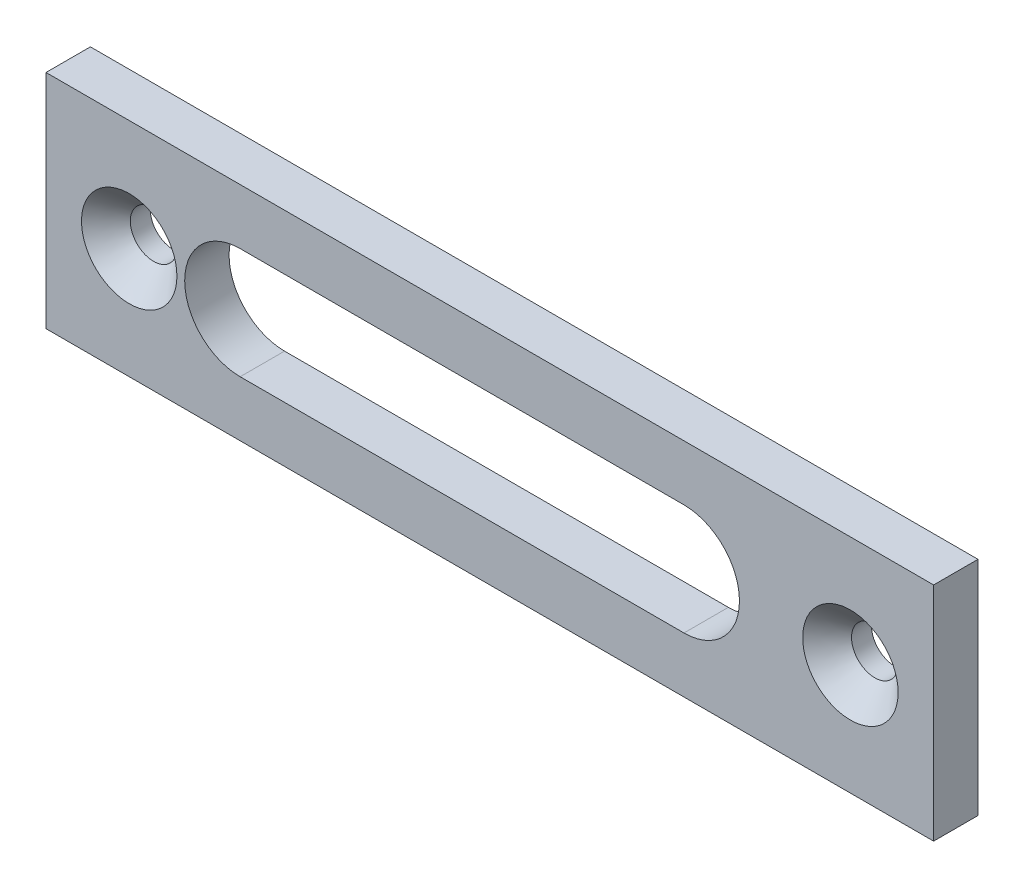
ISO-10303-21;
HEADER;
FILE_DESCRIPTION(('STEP AP214'),'2;1');
FILE_NAME('part.step','',(''),(''),'','','');
FILE_SCHEMA(('AUTOMOTIVE_DESIGN { 1 0 10303 214 1 1 1 1 }'));
ENDSEC;
DATA;
#1=APPLICATION_CONTEXT('core data for automotive mechanical design processes');
#2=APPLICATION_PROTOCOL_DEFINITION('international standard','automotive_design',2000,#1);
#3=PRODUCT_CONTEXT('',#1,'mechanical');
#4=PRODUCT('Part','Part','',(#3));
#5=PRODUCT_RELATED_PRODUCT_CATEGORY('part','',(#4));
#6=PRODUCT_DEFINITION_FORMATION('','',#4);
#7=PRODUCT_DEFINITION_CONTEXT('part definition',#1,'design');
#8=PRODUCT_DEFINITION('design','',#6,#7);
#9=PRODUCT_DEFINITION_SHAPE('','',#8);
#10=(LENGTH_UNIT() NAMED_UNIT(*) SI_UNIT(.MILLI.,.METRE.));
#11=(NAMED_UNIT(*) PLANE_ANGLE_UNIT() SI_UNIT($,.RADIAN.));
#12=(NAMED_UNIT(*) SI_UNIT($,.STERADIAN.) SOLID_ANGLE_UNIT());
#13=UNCERTAINTY_MEASURE_WITH_UNIT(LENGTH_MEASURE(1.E-05),#10,'distance_accuracy_value','');
#14=(GEOMETRIC_REPRESENTATION_CONTEXT(3) GLOBAL_UNCERTAINTY_ASSIGNED_CONTEXT((#13)) GLOBAL_UNIT_ASSIGNED_CONTEXT((#10,
#11,#12)) REPRESENTATION_CONTEXT('',''));
#15=CARTESIAN_POINT('',(0.,0.,0.));
#16=DIRECTION('',(0.,0.,1.));
#17=DIRECTION('',(1.,0.,0.));
#18=AXIS2_PLACEMENT_3D('',#15,#16,#17);
#19=CARTESIAN_POINT('',(-40.,10.,4.));
#20=DIRECTION('',(0.,0.,1.));
#21=DIRECTION('',(1.,0.,0.));
#22=AXIS2_PLACEMENT_3D('',#19,#20,#21);
#23=PLANE('',#22);
#24=CARTESIAN_POINT('',(32.5,0.,4.));
#25=DIRECTION('',(0.,0.,1.));
#26=DIRECTION('',(1.,0.,0.));
#27=AXIS2_PLACEMENT_3D('',#24,#25,#26);
#28=CIRCLE('',#27,4.30000000000001);
#29=CARTESIAN_POINT('',(36.8,0.,4.));
#30=VERTEX_POINT('',#29);
#31=EDGE_CURVE('E34',#30,#30,#28,.F.);
#32=ORIENTED_EDGE('',*,*,#31,.T.);
#33=EDGE_LOOP('',(#32));
#34=FACE_BOUND('',#33,.T.);
#35=CARTESIAN_POINT('',(-32.5,0.,4.));
#36=DIRECTION('',(0.,0.,1.));
#37=DIRECTION('',(1.,0.,0.));
#38=AXIS2_PLACEMENT_3D('',#35,#36,#37);
#39=CIRCLE('',#38,4.30000000000001);
#40=CARTESIAN_POINT('',(-28.2,0.,4.));
#41=VERTEX_POINT('',#40);
#42=EDGE_CURVE('E165',#41,#41,#39,.F.);
#43=ORIENTED_EDGE('',*,*,#42,.T.);
#44=EDGE_LOOP('',(#43));
#45=FACE_BOUND('',#44,.T.);
#46=DIRECTION('',(0.,-1.,0.));
#47=VECTOR('',#46,1.);
#48=CARTESIAN_POINT('',(-40.,10.,4.));
#49=LINE('',#48,#47);
#50=CARTESIAN_POINT('',(-40.,10.,4.));
#51=VERTEX_POINT('',#50);
#52=CARTESIAN_POINT('',(-40.,-10.,4.));
#53=VERTEX_POINT('',#52);
#54=EDGE_CURVE('E141',#51,#53,#49,.T.);
#55=ORIENTED_EDGE('',*,*,#54,.T.);
#56=DIRECTION('',(1.,0.,0.));
#57=VECTOR('',#56,1.);
#58=CARTESIAN_POINT('',(-40.,-10.,4.));
#59=LINE('',#58,#57);
#60=CARTESIAN_POINT('',(40.,-9.99999999999999,4.));
#61=VERTEX_POINT('',#60);
#62=EDGE_CURVE('E144',#53,#61,#59,.T.);
#63=ORIENTED_EDGE('',*,*,#62,.T.);
#64=DIRECTION('',(0.,1.,0.));
#65=VECTOR('',#64,1.);
#66=CARTESIAN_POINT('',(40.,10.,4.));
#67=LINE('',#66,#65);
#68=CARTESIAN_POINT('',(40.,10.,4.));
#69=VERTEX_POINT('',#68);
#70=EDGE_CURVE('E146',#61,#69,#67,.T.);
#71=ORIENTED_EDGE('',*,*,#70,.T.);
#72=DIRECTION('',(-1.,0.,0.));
#73=VECTOR('',#72,1.);
#74=CARTESIAN_POINT('',(-40.,10.,4.));
#75=LINE('',#74,#73);
#76=EDGE_CURVE('E148',#69,#51,#75,.T.);
#77=ORIENTED_EDGE('',*,*,#76,.T.);
#78=EDGE_LOOP('',(#55,#63,#71,#77));
#79=FACE_BOUND('',#78,.T.);
#80=DIRECTION('',(1.,0.,0.));
#81=VECTOR('',#80,1.);
#82=CARTESIAN_POINT('',(-22.5,-5.,4.));
#83=LINE('',#82,#81);
#84=CARTESIAN_POINT('',(-22.5,-5.,4.));
#85=VERTEX_POINT('',#84);
#86=CARTESIAN_POINT('',(17.5,-5.,4.));
#87=VERTEX_POINT('',#86);
#88=EDGE_CURVE('E117',#85,#87,#83,.T.);
#89=ORIENTED_EDGE('',*,*,#88,.F.);
#90=CARTESIAN_POINT('',(-22.5,0.,4.));
#91=DIRECTION('',(0.,0.,1.));
#92=DIRECTION('',(1.,0.,0.));
#93=AXIS2_PLACEMENT_3D('',#90,#91,#92);
#94=CIRCLE('',#93,5.);
#95=CARTESIAN_POINT('',(-22.5,5.,4.));
#96=VERTEX_POINT('',#95);
#97=EDGE_CURVE('E106',#96,#85,#94,.T.);
#98=ORIENTED_EDGE('',*,*,#97,.F.);
#99=DIRECTION('',(-1.,0.,0.));
#100=VECTOR('',#99,1.);
#101=CARTESIAN_POINT('',(-22.5,5.,4.));
#102=LINE('',#101,#100);
#103=CARTESIAN_POINT('',(17.5,5.,4.));
#104=VERTEX_POINT('',#103);
#105=EDGE_CURVE('E121',#104,#96,#102,.T.);
#106=ORIENTED_EDGE('',*,*,#105,.F.);
#107=CARTESIAN_POINT('',(17.5,0.,4.));
#108=DIRECTION('',(0.,0.,1.));
#109=DIRECTION('',(1.,0.,0.));
#110=AXIS2_PLACEMENT_3D('',#107,#108,#109);
#111=CIRCLE('',#110,5.);
#112=EDGE_CURVE('E119',#87,#104,#111,.T.);
#113=ORIENTED_EDGE('',*,*,#112,.F.);
#114=EDGE_LOOP('',(#89,#98,#106,#113));
#115=FACE_BOUND('',#114,.T.);
#116=ADVANCED_FACE('F26',(#34,#45,#79,#115),#23,.T.);
#117=CARTESIAN_POINT('',(-40.,10.,0.));
#118=DIRECTION('',(0.,0.,1.));
#119=DIRECTION('',(1.,0.,0.));
#120=AXIS2_PLACEMENT_3D('',#117,#118,#119);
#121=PLANE('',#120);
#122=CARTESIAN_POINT('',(32.5,0.,0.));
#123=DIRECTION('',(0.,0.,1.));
#124=DIRECTION('',(1.,0.,0.));
#125=AXIS2_PLACEMENT_3D('',#122,#123,#124);
#126=CIRCLE('',#125,2.1);
#127=CARTESIAN_POINT('',(34.6,0.,0.));
#128=VERTEX_POINT('',#127);
#129=EDGE_CURVE('E107',#128,#128,#126,.T.);
#130=ORIENTED_EDGE('',*,*,#129,.T.);
#131=EDGE_LOOP('',(#130));
#132=FACE_BOUND('',#131,.T.);
#133=DIRECTION('',(0.,-1.,0.));
#134=VECTOR('',#133,1.);
#135=CARTESIAN_POINT('',(-40.,10.,0.));
#136=LINE('',#135,#134);
#137=CARTESIAN_POINT('',(-40.,10.,0.));
#138=VERTEX_POINT('',#137);
#139=CARTESIAN_POINT('',(-40.,-10.,0.));
#140=VERTEX_POINT('',#139);
#141=EDGE_CURVE('E132',#138,#140,#136,.T.);
#142=ORIENTED_EDGE('',*,*,#141,.F.);
#143=DIRECTION('',(-1.,0.,0.));
#144=VECTOR('',#143,1.);
#145=CARTESIAN_POINT('',(-40.,10.,0.));
#146=LINE('',#145,#144);
#147=CARTESIAN_POINT('',(40.,10.,0.));
#148=VERTEX_POINT('',#147);
#149=EDGE_CURVE('E139',#148,#138,#146,.T.);
#150=ORIENTED_EDGE('',*,*,#149,.F.);
#151=DIRECTION('',(0.,1.,0.));
#152=VECTOR('',#151,1.);
#153=CARTESIAN_POINT('',(40.,10.,0.));
#154=LINE('',#153,#152);
#155=CARTESIAN_POINT('',(40.,-9.99999999999999,0.));
#156=VERTEX_POINT('',#155);
#157=EDGE_CURVE('E137',#156,#148,#154,.T.);
#158=ORIENTED_EDGE('',*,*,#157,.F.);
#159=DIRECTION('',(1.,0.,0.));
#160=VECTOR('',#159,1.);
#161=CARTESIAN_POINT('',(-40.,-10.,0.));
#162=LINE('',#161,#160);
#163=EDGE_CURVE('E135',#140,#156,#162,.T.);
#164=ORIENTED_EDGE('',*,*,#163,.F.);
#165=EDGE_LOOP('',(#142,#150,#158,#164));
#166=FACE_BOUND('',#165,.T.);
#167=CARTESIAN_POINT('',(-32.5,0.,0.));
#168=DIRECTION('',(0.,0.,1.));
#169=DIRECTION('',(1.,0.,0.));
#170=AXIS2_PLACEMENT_3D('',#167,#168,#169);
#171=CIRCLE('',#170,2.1);
#172=CARTESIAN_POINT('',(-30.4,0.,0.));
#173=VERTEX_POINT('',#172);
#174=EDGE_CURVE('E129',#173,#173,#171,.T.);
#175=ORIENTED_EDGE('',*,*,#174,.T.);
#176=EDGE_LOOP('',(#175));
#177=FACE_BOUND('',#176,.T.);
#178=CARTESIAN_POINT('',(-22.5,0.,0.));
#179=DIRECTION('',(0.,0.,1.));
#180=DIRECTION('',(1.,0.,0.));
#181=AXIS2_PLACEMENT_3D('',#178,#179,#180);
#182=CIRCLE('',#181,5.);
#183=CARTESIAN_POINT('',(-22.5,5.,0.));
#184=VERTEX_POINT('',#183);
#185=CARTESIAN_POINT('',(-22.5,-5.,0.));
#186=VERTEX_POINT('',#185);
#187=EDGE_CURVE('E49',#184,#186,#182,.T.);
#188=ORIENTED_EDGE('',*,*,#187,.T.);
#189=DIRECTION('',(1.,0.,0.));
#190=VECTOR('',#189,1.);
#191=CARTESIAN_POINT('',(-22.5,-5.,0.));
#192=LINE('',#191,#190);
#193=CARTESIAN_POINT('',(17.5,-5.,0.));
#194=VERTEX_POINT('',#193);
#195=EDGE_CURVE('E93',#186,#194,#192,.T.);
#196=ORIENTED_EDGE('',*,*,#195,.T.);
#197=CARTESIAN_POINT('',(17.5,0.,0.));
#198=DIRECTION('',(0.,0.,1.));
#199=DIRECTION('',(1.,0.,0.));
#200=AXIS2_PLACEMENT_3D('',#197,#198,#199);
#201=CIRCLE('',#200,5.);
#202=CARTESIAN_POINT('',(17.5,5.,0.));
#203=VERTEX_POINT('',#202);
#204=EDGE_CURVE('E102',#194,#203,#201,.T.);
#205=ORIENTED_EDGE('',*,*,#204,.T.);
#206=DIRECTION('',(-1.,0.,0.));
#207=VECTOR('',#206,1.);
#208=CARTESIAN_POINT('',(-22.5,5.,0.));
#209=LINE('',#208,#207);
#210=EDGE_CURVE('E111',#203,#184,#209,.T.);
#211=ORIENTED_EDGE('',*,*,#210,.T.);
#212=EDGE_LOOP('',(#188,#196,#205,#211));
#213=FACE_BOUND('',#212,.T.);
#214=ADVANCED_FACE('F110',(#132,#166,#177,#213),#121,.F.);
#215=CARTESIAN_POINT('',(-40.,10.,4.));
#216=DIRECTION('',(1.,0.,0.));
#217=DIRECTION('',(0.,0.,-1.));
#218=AXIS2_PLACEMENT_3D('',#215,#216,#217);
#219=PLANE('',#218);
#220=ORIENTED_EDGE('',*,*,#141,.T.);
#221=DIRECTION('',(0.,0.,-1.));
#222=VECTOR('',#221,1.);
#223=CARTESIAN_POINT('',(-40.,-10.,4.));
#224=LINE('',#223,#222);
#225=EDGE_CURVE('E159',#53,#140,#224,.T.);
#226=ORIENTED_EDGE('',*,*,#225,.F.);
#227=ORIENTED_EDGE('',*,*,#54,.F.);
#228=DIRECTION('',(0.,0.,-1.));
#229=VECTOR('',#228,1.);
#230=CARTESIAN_POINT('',(-40.,10.,4.));
#231=LINE('',#230,#229);
#232=EDGE_CURVE('E150',#51,#138,#231,.T.);
#233=ORIENTED_EDGE('',*,*,#232,.T.);
#234=EDGE_LOOP('',(#220,#226,#227,#233));
#235=FACE_BOUND('',#234,.T.);
#236=ADVANCED_FACE('F28',(#235),#219,.F.);
#237=CARTESIAN_POINT('',(-40.,-10.,4.));
#238=DIRECTION('',(0.,1.,0.));
#239=DIRECTION('',(-1.,0.,0.));
#240=AXIS2_PLACEMENT_3D('',#237,#238,#239);
#241=PLANE('',#240);
#242=ORIENTED_EDGE('',*,*,#163,.T.);
#243=DIRECTION('',(0.,0.,-1.));
#244=VECTOR('',#243,1.);
#245=CARTESIAN_POINT('',(40.,-9.99999999999999,4.));
#246=LINE('',#245,#244);
#247=EDGE_CURVE('E156',#61,#156,#246,.T.);
#248=ORIENTED_EDGE('',*,*,#247,.F.);
#249=ORIENTED_EDGE('',*,*,#62,.F.);
#250=ORIENTED_EDGE('',*,*,#225,.T.);
#251=EDGE_LOOP('',(#242,#248,#249,#250));
#252=FACE_BOUND('',#251,.T.);
#253=ADVANCED_FACE('F212',(#252),#241,.F.);
#254=CARTESIAN_POINT('',(40.,10.,4.));
#255=DIRECTION('',(-1.,0.,0.));
#256=DIRECTION('',(0.,0.,1.));
#257=AXIS2_PLACEMENT_3D('',#254,#255,#256);
#258=PLANE('',#257);
#259=ORIENTED_EDGE('',*,*,#157,.T.);
#260=DIRECTION('',(0.,0.,-1.));
#261=VECTOR('',#260,1.);
#262=CARTESIAN_POINT('',(40.,10.,4.));
#263=LINE('',#262,#261);
#264=EDGE_CURVE('E153',#69,#148,#263,.T.);
#265=ORIENTED_EDGE('',*,*,#264,.F.);
#266=ORIENTED_EDGE('',*,*,#70,.F.);
#267=ORIENTED_EDGE('',*,*,#247,.T.);
#268=EDGE_LOOP('',(#259,#265,#266,#267));
#269=FACE_BOUND('',#268,.T.);
#270=ADVANCED_FACE('F203',(#269),#258,.F.);
#271=CARTESIAN_POINT('',(-40.,10.,4.));
#272=DIRECTION('',(0.,-1.,0.));
#273=DIRECTION('',(1.,0.,0.));
#274=AXIS2_PLACEMENT_3D('',#271,#272,#273);
#275=PLANE('',#274);
#276=ORIENTED_EDGE('',*,*,#149,.T.);
#277=ORIENTED_EDGE('',*,*,#232,.F.);
#278=ORIENTED_EDGE('',*,*,#76,.F.);
#279=ORIENTED_EDGE('',*,*,#264,.T.);
#280=EDGE_LOOP('',(#276,#277,#278,#279));
#281=FACE_BOUND('',#280,.T.);
#282=ADVANCED_FACE('F196',(#281),#275,.F.);
#283=CARTESIAN_POINT('',(-32.5,0.,4.));
#284=DIRECTION('',(0.,0.,-1.));
#285=DIRECTION('',(-1.,0.,0.));
#286=AXIS2_PLACEMENT_3D('',#283,#284,#285);
#287=CYLINDRICAL_SURFACE('',#286,2.1);
#288=CARTESIAN_POINT('',(-32.5,0.,1.8));
#289=DIRECTION('',(0.,0.,1.));
#290=DIRECTION('',(1.,0.,0.));
#291=AXIS2_PLACEMENT_3D('',#288,#289,#290);
#292=CIRCLE('',#291,2.1);
#293=CARTESIAN_POINT('',(-30.4,0.,1.8));
#294=VERTEX_POINT('',#293);
#295=EDGE_CURVE('E11',#294,#294,#292,.T.);
#296=ORIENTED_EDGE('',*,*,#295,.T.);
#297=EDGE_LOOP('',(#296));
#298=FACE_BOUND('',#297,.T.);
#299=ORIENTED_EDGE('',*,*,#174,.F.);
#300=EDGE_LOOP('',(#299));
#301=FACE_BOUND('',#300,.T.);
#302=ADVANCED_FACE('F183',(#298,#301),#287,.F.);
#303=CARTESIAN_POINT('',(32.5,0.,4.));
#304=DIRECTION('',(0.,0.,-1.));
#305=DIRECTION('',(-1.,0.,0.));
#306=AXIS2_PLACEMENT_3D('',#303,#304,#305);
#307=CYLINDRICAL_SURFACE('',#306,2.1);
#308=CARTESIAN_POINT('',(32.5,0.,1.8));
#309=DIRECTION('',(0.,0.,1.));
#310=DIRECTION('',(1.,0.,0.));
#311=AXIS2_PLACEMENT_3D('',#308,#309,#310);
#312=CIRCLE('',#311,2.1);
#313=CARTESIAN_POINT('',(34.6,0.,1.8));
#314=VERTEX_POINT('',#313);
#315=EDGE_CURVE('E162',#314,#314,#312,.T.);
#316=ORIENTED_EDGE('',*,*,#315,.T.);
#317=EDGE_LOOP('',(#316));
#318=FACE_BOUND('',#317,.T.);
#319=ORIENTED_EDGE('',*,*,#129,.F.);
#320=EDGE_LOOP('',(#319));
#321=FACE_BOUND('',#320,.T.);
#322=ADVANCED_FACE('F180',(#318,#321),#307,.F.);
#323=CARTESIAN_POINT('',(-22.5,0.,4.));
#324=DIRECTION('',(0.,0.,-1.));
#325=DIRECTION('',(-1.,0.,0.));
#326=AXIS2_PLACEMENT_3D('',#323,#324,#325);
#327=CYLINDRICAL_SURFACE('',#326,5.);
#328=ORIENTED_EDGE('',*,*,#187,.F.);
#329=DIRECTION('',(0.,0.,-1.));
#330=VECTOR('',#329,1.);
#331=CARTESIAN_POINT('',(-22.5,5.,4.));
#332=LINE('',#331,#330);
#333=EDGE_CURVE('E123',#96,#184,#332,.T.);
#334=ORIENTED_EDGE('',*,*,#333,.F.);
#335=ORIENTED_EDGE('',*,*,#97,.T.);
#336=DIRECTION('',(0.,0.,-1.));
#337=VECTOR('',#336,1.);
#338=CARTESIAN_POINT('',(-22.5,-5.,4.));
#339=LINE('',#338,#337);
#340=EDGE_CURVE('E95',#85,#186,#339,.T.);
#341=ORIENTED_EDGE('',*,*,#340,.T.);
#342=EDGE_LOOP('',(#328,#334,#335,#341));
#343=FACE_BOUND('',#342,.T.);
#344=ADVANCED_FACE('F104',(#343),#327,.F.);
#345=CARTESIAN_POINT('',(-22.5,-5.,4.));
#346=DIRECTION('',(0.,1.,0.));
#347=DIRECTION('',(-1.,0.,0.));
#348=AXIS2_PLACEMENT_3D('',#345,#346,#347);
#349=PLANE('',#348);
#350=ORIENTED_EDGE('',*,*,#195,.F.);
#351=ORIENTED_EDGE('',*,*,#340,.F.);
#352=ORIENTED_EDGE('',*,*,#88,.T.);
#353=DIRECTION('',(0.,0.,-1.));
#354=VECTOR('',#353,1.);
#355=CARTESIAN_POINT('',(17.5,-5.,4.));
#356=LINE('',#355,#354);
#357=EDGE_CURVE('E98',#87,#194,#356,.T.);
#358=ORIENTED_EDGE('',*,*,#357,.T.);
#359=EDGE_LOOP('',(#350,#351,#352,#358));
#360=FACE_BOUND('',#359,.T.);
#361=ADVANCED_FACE('F94',(#360),#349,.T.);
#362=CARTESIAN_POINT('',(17.5,0.,4.));
#363=DIRECTION('',(0.,0.,-1.));
#364=DIRECTION('',(-1.,0.,0.));
#365=AXIS2_PLACEMENT_3D('',#362,#363,#364);
#366=CYLINDRICAL_SURFACE('',#365,5.);
#367=ORIENTED_EDGE('',*,*,#204,.F.);
#368=ORIENTED_EDGE('',*,*,#357,.F.);
#369=ORIENTED_EDGE('',*,*,#112,.T.);
#370=DIRECTION('',(0.,0.,-1.));
#371=VECTOR('',#370,1.);
#372=CARTESIAN_POINT('',(17.5,5.,4.));
#373=LINE('',#372,#371);
#374=EDGE_CURVE('E41',#104,#203,#373,.T.);
#375=ORIENTED_EDGE('',*,*,#374,.T.);
#376=EDGE_LOOP('',(#367,#368,#369,#375));
#377=FACE_BOUND('',#376,.T.);
#378=ADVANCED_FACE('F233',(#377),#366,.F.);
#379=CARTESIAN_POINT('',(-22.5,5.,4.));
#380=DIRECTION('',(0.,-1.,0.));
#381=DIRECTION('',(1.,0.,0.));
#382=AXIS2_PLACEMENT_3D('',#379,#380,#381);
#383=PLANE('',#382);
#384=ORIENTED_EDGE('',*,*,#210,.F.);
#385=ORIENTED_EDGE('',*,*,#374,.F.);
#386=ORIENTED_EDGE('',*,*,#105,.T.);
#387=ORIENTED_EDGE('',*,*,#333,.T.);
#388=EDGE_LOOP('',(#384,#385,#386,#387));
#389=FACE_BOUND('',#388,.T.);
#390=ADVANCED_FACE('F176',(#389),#383,.T.);
#391=CARTESIAN_POINT('',(32.5,0.,1.8));
#392=DIRECTION('',(0.,0.,1.));
#393=DIRECTION('',(1.,0.,0.));
#394=AXIS2_PLACEMENT_3D('',#391,#392,#393);
#395=CONICAL_SURFACE('',#394,2.1,0.78539816339745);
#396=ORIENTED_EDGE('',*,*,#31,.F.);
#397=EDGE_LOOP('',(#396));
#398=FACE_BOUND('',#397,.T.);
#399=ORIENTED_EDGE('',*,*,#315,.F.);
#400=EDGE_LOOP('',(#399));
#401=FACE_BOUND('',#400,.T.);
#402=ADVANCED_FACE('F172',(#398,#401),#395,.F.);
#403=CARTESIAN_POINT('',(-32.5,0.,1.8));
#404=DIRECTION('',(0.,0.,1.));
#405=DIRECTION('',(1.,0.,0.));
#406=AXIS2_PLACEMENT_3D('',#403,#404,#405);
#407=CONICAL_SURFACE('',#406,2.1,0.785398163397451);
#408=ORIENTED_EDGE('',*,*,#42,.F.);
#409=EDGE_LOOP('',(#408));
#410=FACE_BOUND('',#409,.T.);
#411=ORIENTED_EDGE('',*,*,#295,.F.);
#412=EDGE_LOOP('',(#411));
#413=FACE_BOUND('',#412,.T.);
#414=ADVANCED_FACE('F175',(#410,#413),#407,.F.);
#415=CLOSED_SHELL('',(#116,#214,#236,#253,#270,#282,#302,#322,#344,#361,#378,#390,#402,#414));
#416=MANIFOLD_SOLID_BREP('B2',#415);
#417=ADVANCED_BREP_SHAPE_REPRESENTATION('',(#18,#416),#14);
#418=SHAPE_DEFINITION_REPRESENTATION(#9,#417);
ENDSEC;
END-ISO-10303-21;
